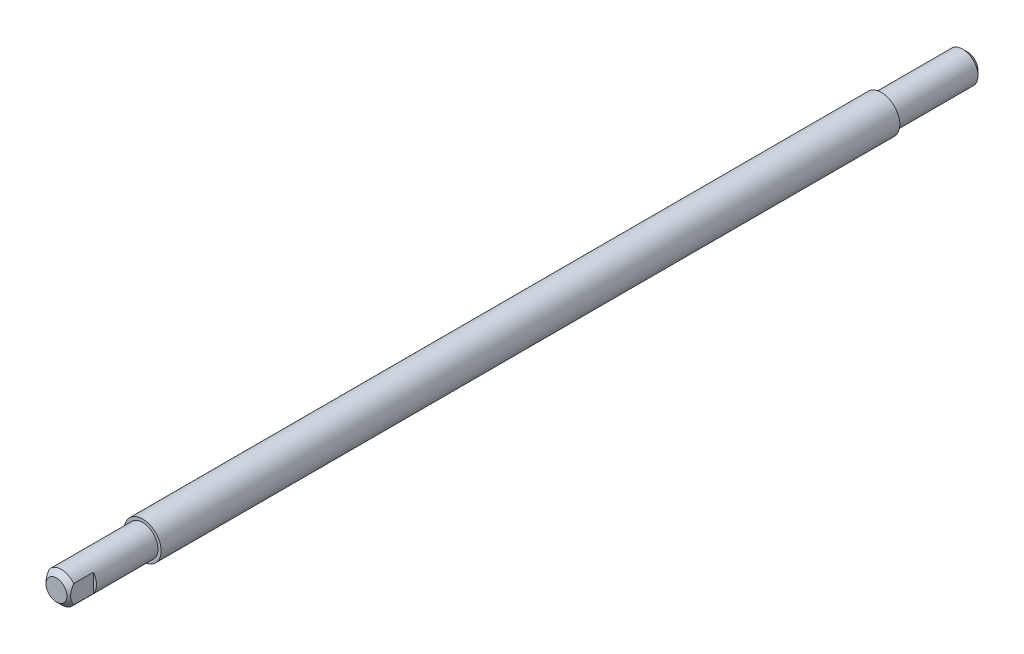
ISO-10303-21;
HEADER;
FILE_DESCRIPTION(('STEP AP214'),'2;1');
FILE_NAME('part.step','',(''),(''),'','','');
FILE_SCHEMA(('AUTOMOTIVE_DESIGN { 1 0 10303 214 1 1 1 1 }'));
ENDSEC;
DATA;
#1=APPLICATION_CONTEXT('core data for automotive mechanical design processes');
#2=APPLICATION_PROTOCOL_DEFINITION('international standard','automotive_design',2000,#1);
#3=PRODUCT_CONTEXT('',#1,'mechanical');
#4=PRODUCT('Part','Part','',(#3));
#5=PRODUCT_RELATED_PRODUCT_CATEGORY('part','',(#4));
#6=PRODUCT_DEFINITION_FORMATION('','',#4);
#7=PRODUCT_DEFINITION_CONTEXT('part definition',#1,'design');
#8=PRODUCT_DEFINITION('design','',#6,#7);
#9=PRODUCT_DEFINITION_SHAPE('','',#8);
#10=(LENGTH_UNIT() NAMED_UNIT(*) SI_UNIT(.MILLI.,.METRE.));
#11=(NAMED_UNIT(*) PLANE_ANGLE_UNIT() SI_UNIT($,.RADIAN.));
#12=(NAMED_UNIT(*) SI_UNIT($,.STERADIAN.) SOLID_ANGLE_UNIT());
#13=UNCERTAINTY_MEASURE_WITH_UNIT(LENGTH_MEASURE(1.E-05),#10,'distance_accuracy_value','');
#14=(GEOMETRIC_REPRESENTATION_CONTEXT(3) GLOBAL_UNCERTAINTY_ASSIGNED_CONTEXT((#13)) GLOBAL_UNIT_ASSIGNED_CONTEXT((#10,
#11,#12)) REPRESENTATION_CONTEXT('',''));
#15=CARTESIAN_POINT('',(0.,0.,0.));
#16=DIRECTION('',(0.,0.,1.));
#17=DIRECTION('',(1.,0.,0.));
#18=AXIS2_PLACEMENT_3D('',#15,#16,#17);
#19=CARTESIAN_POINT('',(0.,0.,234.95));
#20=DIRECTION('',(0.,0.,-1.));
#21=DIRECTION('',(-1.,0.,0.));
#22=AXIS2_PLACEMENT_3D('',#19,#20,#21);
#23=CYLINDRICAL_SURFACE('',#22,3.96875);
#24=CARTESIAN_POINT('',(0.,0.,1.26999999999999));
#25=DIRECTION('',(0.,0.,1.));
#26=DIRECTION('',(1.,0.,0.));
#27=AXIS2_PLACEMENT_3D('',#24,#25,#26);
#28=CIRCLE('',#27,3.96875);
#29=CARTESIAN_POINT('',(3.96875,0.,1.26999999999999));
#30=VERTEX_POINT('',#29);
#31=EDGE_CURVE('E118',#30,#30,#28,.T.);
#32=ORIENTED_EDGE('',*,*,#31,.T.);
#33=EDGE_LOOP('',(#32));
#34=FACE_BOUND('',#33,.T.);
#35=CARTESIAN_POINT('',(0.,0.,22.225));
#36=DIRECTION('',(0.,0.,-1.));
#37=DIRECTION('',(-1.,0.,0.));
#38=AXIS2_PLACEMENT_3D('',#35,#36,#37);
#39=CIRCLE('',#38,3.96875);
#40=CARTESIAN_POINT('',(-3.96875,0.,22.225));
#41=VERTEX_POINT('',#40);
#42=EDGE_CURVE('E129',#41,#41,#39,.T.);
#43=ORIENTED_EDGE('',*,*,#42,.T.);
#44=EDGE_LOOP('',(#43));
#45=FACE_BOUND('',#44,.T.);
#46=ADVANCED_FACE('F50',(#34,#45),#23,.T.);
#47=CARTESIAN_POINT('',(0.,0.,0.));
#48=DIRECTION('',(0.,0.,1.));
#49=DIRECTION('',(1.,0.,0.));
#50=AXIS2_PLACEMENT_3D('',#47,#48,#49);
#51=PLANE('',#50);
#52=CARTESIAN_POINT('',(0.,0.,0.));
#53=DIRECTION('',(0.,0.,1.));
#54=DIRECTION('',(1.,0.,0.));
#55=AXIS2_PLACEMENT_3D('',#52,#53,#54);
#56=CIRCLE('',#55,2.69875);
#57=CARTESIAN_POINT('',(2.69875,0.,0.));
#58=VERTEX_POINT('',#57);
#59=EDGE_CURVE('E122',#58,#58,#56,.F.);
#60=ORIENTED_EDGE('',*,*,#59,.T.);
#61=EDGE_LOOP('',(#60));
#62=FACE_BOUND('',#61,.T.);
#63=ADVANCED_FACE('F180',(#62),#51,.F.);
#64=CARTESIAN_POINT('',(0.,0.,1.26999999999999));
#65=DIRECTION('',(0.,0.,1.));
#66=DIRECTION('',(1.,0.,0.));
#67=AXIS2_PLACEMENT_3D('',#64,#65,#66);
#68=CONICAL_SURFACE('',#67,3.96875,0.78539816339745);
#69=ORIENTED_EDGE('',*,*,#59,.F.);
#70=EDGE_LOOP('',(#69));
#71=FACE_BOUND('',#70,.T.);
#72=ORIENTED_EDGE('',*,*,#31,.F.);
#73=EDGE_LOOP('',(#72));
#74=FACE_BOUND('',#73,.T.);
#75=ADVANCED_FACE('F52',(#71,#74),#68,.T.);
#76=CARTESIAN_POINT('',(-3.96874999999998,0.,212.725));
#77=DIRECTION('',(0.,0.,1.));
#78=DIRECTION('',(1.,0.,0.));
#79=AXIS2_PLACEMENT_3D('',#76,#77,#78);
#80=PLANE('',#79);
#81=CARTESIAN_POINT('',(0.,0.,212.725));
#82=DIRECTION('',(0.,0.,1.));
#83=DIRECTION('',(1.,0.,0.));
#84=AXIS2_PLACEMENT_3D('',#81,#82,#83);
#85=CIRCLE('',#84,3.96875);
#86=CARTESIAN_POINT('',(3.96875,0.,212.725));
#87=VERTEX_POINT('',#86);
#88=EDGE_CURVE('E125',#87,#87,#85,.T.);
#89=ORIENTED_EDGE('',*,*,#88,.F.);
#90=EDGE_LOOP('',(#89));
#91=FACE_BOUND('',#90,.T.);
#92=CARTESIAN_POINT('',(0.,0.,212.725));
#93=DIRECTION('',(0.,0.,-1.));
#94=DIRECTION('',(-1.,0.,0.));
#95=AXIS2_PLACEMENT_3D('',#92,#93,#94);
#96=CIRCLE('',#95,4.76249999999997);
#97=CARTESIAN_POINT('',(-4.76249999999997,0.,212.725));
#98=VERTEX_POINT('',#97);
#99=EDGE_CURVE('E97',#98,#98,#96,.T.);
#100=ORIENTED_EDGE('',*,*,#99,.F.);
#101=EDGE_LOOP('',(#100));
#102=FACE_BOUND('',#101,.T.);
#103=ADVANCED_FACE('F159',(#91,#102),#80,.T.);
#104=CARTESIAN_POINT('',(0.,0.,-16.320632546804));
#105=DIRECTION('',(0.,0.,-1.));
#106=DIRECTION('',(-1.,0.,0.));
#107=AXIS2_PLACEMENT_3D('',#104,#105,#106);
#108=CYLINDRICAL_SURFACE('',#107,4.76249999999998);
#109=ORIENTED_EDGE('',*,*,#99,.T.);
#110=EDGE_LOOP('',(#109));
#111=FACE_BOUND('',#110,.T.);
#112=CARTESIAN_POINT('',(0.,0.,22.225));
#113=DIRECTION('',(0.,0.,-1.));
#114=DIRECTION('',(-1.,0.,0.));
#115=AXIS2_PLACEMENT_3D('',#112,#113,#114);
#116=CIRCLE('',#115,4.7625);
#117=CARTESIAN_POINT('',(-4.7625,0.,22.225));
#118=VERTEX_POINT('',#117);
#119=EDGE_CURVE('E309',#118,#118,#116,.T.);
#120=ORIENTED_EDGE('',*,*,#119,.F.);
#121=EDGE_LOOP('',(#120));
#122=FACE_BOUND('',#121,.T.);
#123=ADVANCED_FACE('F162',(#111,#122),#108,.T.);
#124=CARTESIAN_POINT('',(-3.96875,0.,22.225));
#125=DIRECTION('',(0.,0.,-1.));
#126=DIRECTION('',(-1.,0.,0.));
#127=AXIS2_PLACEMENT_3D('',#124,#125,#126);
#128=PLANE('',#127);
#129=ORIENTED_EDGE('',*,*,#119,.T.);
#130=EDGE_LOOP('',(#129));
#131=FACE_BOUND('',#130,.T.);
#132=ORIENTED_EDGE('',*,*,#42,.F.);
#133=EDGE_LOOP('',(#132));
#134=FACE_BOUND('',#133,.T.);
#135=ADVANCED_FACE('F166',(#131,#134),#128,.T.);
#136=CARTESIAN_POINT('',(0.,0.,234.95));
#137=DIRECTION('',(0.,0.,1.));
#138=DIRECTION('',(1.,0.,0.));
#139=AXIS2_PLACEMENT_3D('',#136,#137,#138);
#140=PLANE('',#139);
#141=CARTESIAN_POINT('',(0.,0.,234.95));
#142=DIRECTION('',(0.,0.,1.));
#143=DIRECTION('',(1.,0.,0.));
#144=AXIS2_PLACEMENT_3D('',#141,#142,#143);
#145=CIRCLE('',#144,2.69875000000001);
#146=CARTESIAN_POINT('',(2.69875,0.,234.95));
#147=VERTEX_POINT('',#146);
#148=EDGE_CURVE('E115',#147,#147,#145,.T.);
#149=ORIENTED_EDGE('',*,*,#148,.T.);
#150=EDGE_LOOP('',(#149));
#151=FACE_BOUND('',#150,.T.);
#152=ADVANCED_FACE('F169',(#151),#140,.T.);
#153=CARTESIAN_POINT('',(3.96875000000002,-3.96875,228.6));
#154=DIRECTION('',(0.,0.,-1.));
#155=DIRECTION('',(-1.,0.,0.));
#156=AXIS2_PLACEMENT_3D('',#153,#154,#155);
#157=PLANE('',#156);
#158=DIRECTION('',(0.,1.,0.));
#159=VECTOR('',#158,1.);
#160=CARTESIAN_POINT('',(3.17500000000003,-3.96875,228.6));
#161=LINE('',#160,#159);
#162=CARTESIAN_POINT('',(3.17500000000002,-2.38124999999997,228.6));
#163=VERTEX_POINT('',#162);
#164=CARTESIAN_POINT('',(3.17500000000003,2.38124999999996,228.6));
#165=VERTEX_POINT('',#164);
#166=EDGE_CURVE('E105',#163,#165,#161,.T.);
#167=ORIENTED_EDGE('',*,*,#166,.F.);
#168=CARTESIAN_POINT('',(0.,0.,228.6));
#169=DIRECTION('',(0.,0.,-1.));
#170=DIRECTION('',(-1.,0.,0.));
#171=AXIS2_PLACEMENT_3D('',#168,#169,#170);
#172=CIRCLE('',#171,3.96875);
#173=EDGE_CURVE('E139',#165,#163,#172,.T.);
#174=ORIENTED_EDGE('',*,*,#173,.F.);
#175=EDGE_LOOP('',(#167,#174));
#176=FACE_BOUND('',#175,.T.);
#177=ADVANCED_FACE('F174',(#176),#157,.F.);
#178=CARTESIAN_POINT('',(3.17500000000003,-3.96875,228.6));
#179=DIRECTION('',(-1.,0.,0.));
#180=DIRECTION('',(0.,0.,1.));
#181=AXIS2_PLACEMENT_3D('',#178,#179,#180);
#182=PLANE('',#181);
#183=CARTESIAN_POINT('',(3.17500000000002,-5.78325018162707,231.051280207474));
#184=CARTESIAN_POINT('',(3.17500000000002,-5.64632479657924,231.171285469388));
#185=CARTESIAN_POINT('',(3.17500000000003,-5.50892779177499,231.290758495077));
#186=CARTESIAN_POINT('',(3.17500000000003,-5.23293779177755,231.528353140146));
#187=CARTESIAN_POINT('',(3.17500000000003,-5.09434463285967,231.646474569209));
#188=CARTESIAN_POINT('',(3.17500000000003,-4.81492910065498,231.881734632633));
#189=CARTESIAN_POINT('',(3.17500000000003,-4.67409841409708,231.998863414989));
#190=CARTESIAN_POINT('',(3.17500000000003,-4.39069596795591,232.230981133771));
#191=CARTESIAN_POINT('',(3.17500000000003,-4.24812432000275,232.345970206213));
#192=CARTESIAN_POINT('',(3.17500000000003,-3.94990485096295,232.581855948903));
#193=CARTESIAN_POINT('',(3.17500000000003,-3.79408647133764,232.702537774134));
#194=CARTESIAN_POINT('',(3.17500000000003,-3.47927861833636,232.939686998169));
#195=CARTESIAN_POINT('',(3.17500000000003,-3.32028942686246,233.056154769056));
#196=CARTESIAN_POINT('',(3.17500000000003,-2.99860258159018,233.283058776025));
#197=CARTESIAN_POINT('',(3.17500000000003,-2.83591458283203,233.393508619438));
#198=CARTESIAN_POINT('',(3.17500000000003,-2.50535426762209,233.606301766068));
#199=CARTESIAN_POINT('',(3.17500000000003,-2.33748461623088,233.708649143127));
#200=CARTESIAN_POINT('',(3.17500000000003,-2.05073499996866,233.87024887126));
#201=CARTESIAN_POINT('',(3.17500000000003,-1.93366543636979,233.932696345507));
#202=CARTESIAN_POINT('',(3.17500000000003,-1.69599314979767,234.050644686561));
#203=CARTESIAN_POINT('',(3.17500000000003,-1.57538944323401,234.106143596407));
#204=CARTESIAN_POINT('',(3.17500000000003,-1.33182173625757,234.207491074043));
#205=CARTESIAN_POINT('',(3.17500000000003,-1.20890274728884,234.253446375068));
#206=CARTESIAN_POINT('',(3.17500000000003,-0.959399491079349,234.334058502219));
#207=CARTESIAN_POINT('',(3.17500000000003,-0.832817419856244,234.368721951047));
#208=CARTESIAN_POINT('',(3.17500000000003,-0.611751283219239,234.416627134184));
#209=CARTESIAN_POINT('',(3.17500000000003,-0.517975658667672,234.433136026415));
#210=CARTESIAN_POINT('',(3.17500000000003,-0.329355685775057,234.458080308119));
#211=CARTESIAN_POINT('',(3.17500000000003,-0.234511569756814,234.466517419629));
#212=CARTESIAN_POINT('',(3.17500000000003,-0.0446050530399451,234.47485120548));
#213=CARTESIAN_POINT('',(3.17500000000003,0.0504567004755422,234.474762405637));
#214=CARTESIAN_POINT('',(3.17500000000003,0.240198292778957,234.466089080997));
#215=CARTESIAN_POINT('',(3.17500000000003,0.334878061513709,234.457503063173));
#216=CARTESIAN_POINT('',(3.17500000000003,0.543538088796841,234.429559318412));
#217=CARTESIAN_POINT('',(3.17500000000003,0.65726003352206,234.408272282409));
#218=CARTESIAN_POINT('',(3.17500000000003,0.882230026530255,234.355275649816));
#219=CARTESIAN_POINT('',(3.17500000000003,0.993477200233816,234.323562429196));
#220=CARTESIAN_POINT('',(3.17500000000003,1.21482367872007,234.250910736841));
#221=CARTESIAN_POINT('',(3.17500000000003,1.32487741597348,234.209835024753));
#222=CARTESIAN_POINT('',(3.17500000000003,1.48768178520232,234.142843922773));
#223=CARTESIAN_POINT('',(3.17500000000003,1.54156607942109,234.119619488901));
#224=CARTESIAN_POINT('',(3.17500000000003,1.64861121874325,234.071564222546));
#225=CARTESIAN_POINT('',(3.17500000000003,1.70177210097693,234.046733472889));
#226=CARTESIAN_POINT('',(3.17500000000003,1.86878948462338,233.965953030637));
#227=CARTESIAN_POINT('',(3.17500000000003,1.98137927401281,233.907376983165));
#228=CARTESIAN_POINT('',(3.17500000000003,2.20371363271771,233.785025868323));
#229=CARTESIAN_POINT('',(3.17500000000003,2.31345717428476,233.721248956502));
#230=CARTESIAN_POINT('',(3.17500000000003,2.53059715044188,233.589551957182));
#231=CARTESIAN_POINT('',(3.17500000000003,2.63799062408732,233.521627010527));
#232=CARTESIAN_POINT('',(3.17500000000003,2.8506725861586,233.382546840962));
#233=CARTESIAN_POINT('',(3.17500000000003,2.95596082185337,233.311391233528));
#234=CARTESIAN_POINT('',(3.17500000000003,3.16539186832447,233.166048759312));
#235=CARTESIAN_POINT('',(3.17500000000002,3.2695234502373,233.09184576402));
#236=CARTESIAN_POINT('',(3.17500000000002,3.47624549345331,232.941319470728));
#237=CARTESIAN_POINT('',(3.17500000000002,3.57883587819868,232.864996067933));
#238=CARTESIAN_POINT('',(3.17500000000002,3.8844996023188,232.63355669121));
#239=CARTESIAN_POINT('',(3.17500000000002,4.08562026993167,232.475862390488));
#240=CARTESIAN_POINT('',(3.17500000000002,4.46060627321295,232.174559478772));
#241=CARTESIAN_POINT('',(3.17500000000002,4.63489609055385,232.031474455738));
#242=CARTESIAN_POINT('',(3.17500000000002,4.98118866424246,231.742502384854));
#243=CARTESIAN_POINT('',(3.17500000000002,5.15319099755769,231.596614830589));
#244=CARTESIAN_POINT('',(3.17500000000002,5.49310484713005,231.304671460912));
#245=CARTESIAN_POINT('',(3.17500000000002,5.66104036715597,231.158643508011));
#246=CARTESIAN_POINT('',(3.17500000000002,5.99542375738034,230.864985323863));
#247=CARTESIAN_POINT('',(3.17500000000002,6.16187202505755,230.717355545582));
#248=CARTESIAN_POINT('',(3.17500000000003,6.32776650522697,230.569113431314));
#249=B_SPLINE_CURVE_WITH_KNOTS('',3,(#183,#184,#185,#186,#187,#188,#189,#190,#191,#192,#193,
#194,#195,#196,#197,#198,#199,#200,#201,#202,#203,#204,#205,#206,#207,#208,#209,#210,#211,#212,
#213,#214,#215,#216,#217,#218,#219,#220,#221,#222,#223,#224,#225,#226,#227,#228,#229,#230,#231,
#232,#233,#234,#235,#236,#237,#238,#239,#240,#241,#242,#243,#244,#245,#246,#247,#248),
.UNSPECIFIED.,.F.,.F.,(4,2,2,2,2,2,2,2,2,2,2,2,2,2,2,2,2,2,2,2,2,2,2,2,2,2,2,2,2,2,2,2,4),(0.,
0.546217179558988,1.09251034778344,1.64201323045215,2.19148106221013,2.7826916127948,
3.37384983387739,3.96361059339487,4.55307291832712,4.95095197367467,5.34894283493716,
5.74220938713478,6.13524487041552,6.42058843222445,6.7058711051536,6.99066774325955,
7.27551443121213,7.62201750654849,7.96864115019815,8.32071609037011,8.49672382434774,
8.67272249010623,9.05327320726021,9.43395947603701,9.81510058251806,10.1962871730615,
10.5798495370327,10.9634308915911,11.7300257889622,12.4064961010063,13.083089822525,
13.7507152119494,14.4181564898844),.UNSPECIFIED.);
#250=CARTESIAN_POINT('',(3.17500000000003,2.38124999999996,233.68));
#251=VERTEX_POINT('',#250);
#252=CARTESIAN_POINT('',(3.17500000000003,-2.38125,233.68));
#253=VERTEX_POINT('',#252);
#254=EDGE_CURVE('E133',#251,#253,#249,.F.);
#255=ORIENTED_EDGE('',*,*,#254,.T.);
#256=DIRECTION('',(0.,0.,-1.));
#257=VECTOR('',#256,1.);
#258=CARTESIAN_POINT('',(3.17500000000002,-2.38124999999997,234.95));
#259=LINE('',#258,#257);
#260=EDGE_CURVE('E108',#163,#253,#259,.F.);
#261=ORIENTED_EDGE('',*,*,#260,.F.);
#262=ORIENTED_EDGE('',*,*,#166,.T.);
#263=DIRECTION('',(0.,0.,-1.));
#264=VECTOR('',#263,1.);
#265=CARTESIAN_POINT('',(3.17500000000003,2.38124999999996,234.95));
#266=LINE('',#265,#264);
#267=EDGE_CURVE('E113',#251,#165,#266,.T.);
#268=ORIENTED_EDGE('',*,*,#267,.F.);
#269=EDGE_LOOP('',(#255,#261,#262,#268));
#270=FACE_BOUND('',#269,.T.);
#271=ADVANCED_FACE('F140',(#270),#182,.F.);
#272=CARTESIAN_POINT('',(0.,0.,234.95));
#273=DIRECTION('',(0.,0.,-1.));
#274=DIRECTION('',(-1.,0.,0.));
#275=AXIS2_PLACEMENT_3D('',#272,#273,#274);
#276=CONICAL_SURFACE('',#275,2.69875000000001,0.785398163397448);
#277=CARTESIAN_POINT('',(-3.17499999999997,-5.78325018162706,231.051280207474));
#278=CARTESIAN_POINT('',(-3.17499999999997,-5.64632479657924,231.171285469388));
#279=CARTESIAN_POINT('',(-3.17499999999998,-5.50892779177501,231.290758495077));
#280=CARTESIAN_POINT('',(-3.17499999999998,-5.23293779177758,231.528353140146));
#281=CARTESIAN_POINT('',(-3.17499999999998,-5.09434463285969,231.646474569209));
#282=CARTESIAN_POINT('',(-3.17499999999998,-4.81492910065501,231.881734632633));
#283=CARTESIAN_POINT('',(-3.17499999999998,-4.67409841409712,231.998863414989));
#284=CARTESIAN_POINT('',(-3.17499999999998,-4.39069596795596,232.230981133771));
#285=CARTESIAN_POINT('',(-3.17499999999998,-4.24812432000279,232.345970206213));
#286=CARTESIAN_POINT('',(-3.17499999999998,-3.94990485096299,232.581855948903));
#287=CARTESIAN_POINT('',(-3.17499999999998,-3.79408647133768,232.702537774134));
#288=CARTESIAN_POINT('',(-3.17499999999998,-3.4792786183364,232.939686998169));
#289=CARTESIAN_POINT('',(-3.17499999999998,-3.32028942686249,233.056154769056));
#290=CARTESIAN_POINT('',(-3.17499999999998,-2.9986025815902,233.283058776025));
#291=CARTESIAN_POINT('',(-3.17499999999998,-2.83591458283205,233.393508619438));
#292=CARTESIAN_POINT('',(-3.17499999999997,-2.5053542676221,233.606301766068));
#293=CARTESIAN_POINT('',(-3.17499999999997,-2.3374846162309,233.708649143127));
#294=CARTESIAN_POINT('',(-3.17499999999997,-2.05073499996869,233.87024887126));
#295=CARTESIAN_POINT('',(-3.17499999999998,-1.93366543636982,233.932696345507));
#296=CARTESIAN_POINT('',(-3.17499999999998,-1.6959931497977,234.050644686561));
#297=CARTESIAN_POINT('',(-3.17499999999998,-1.57538944323404,234.106143596407));
#298=CARTESIAN_POINT('',(-3.17499999999998,-1.33182173625761,234.207491074043));
#299=CARTESIAN_POINT('',(-3.17499999999998,-1.20890274728888,234.253446375068));
#300=CARTESIAN_POINT('',(-3.17499999999997,-0.959399491079381,234.334058502219));
#301=CARTESIAN_POINT('',(-3.17499999999997,-0.832817419856274,234.368721951047));
#302=CARTESIAN_POINT('',(-3.17499999999997,-0.611751283219268,234.416627134184));
#303=CARTESIAN_POINT('',(-3.17499999999997,-0.517975658667703,234.433136026415));
#304=CARTESIAN_POINT('',(-3.17499999999998,-0.329355685775092,234.458080308119));
#305=CARTESIAN_POINT('',(-3.17499999999998,-0.234511569756851,234.466517419629));
#306=CARTESIAN_POINT('',(-3.17499999999998,-0.0446050530399848,234.47485120548));
#307=CARTESIAN_POINT('',(-3.17499999999998,0.0504567004755009,234.474762405637));
#308=CARTESIAN_POINT('',(-3.17499999999998,0.240198292778911,234.466089080997));
#309=CARTESIAN_POINT('',(-3.17499999999998,0.334878061513661,234.457503063173));
#310=CARTESIAN_POINT('',(-3.17499999999998,0.54353808879679,234.429559318412));
#311=CARTESIAN_POINT('',(-3.17499999999998,0.657260033522008,234.408272282409));
#312=CARTESIAN_POINT('',(-3.17499999999998,0.882230026530198,234.355275649816));
#313=CARTESIAN_POINT('',(-3.17499999999998,0.993477200233755,234.323562429196));
#314=CARTESIAN_POINT('',(-3.17499999999998,1.21482367872,234.250910736841));
#315=CARTESIAN_POINT('',(-3.17499999999998,1.3248774159734,234.209835024753));
#316=CARTESIAN_POINT('',(-3.17499999999998,1.48768178520224,234.142843922773));
#317=CARTESIAN_POINT('',(-3.17499999999998,1.54156607942101,234.119619488901));
#318=CARTESIAN_POINT('',(-3.17499999999998,1.64861121874316,234.071564222546));
#319=CARTESIAN_POINT('',(-3.17499999999998,1.70177210097684,234.046733472889));
#320=CARTESIAN_POINT('',(-3.17499999999998,1.86878948462326,233.965953030637));
#321=CARTESIAN_POINT('',(-3.17499999999998,1.98137927401269,233.907376983165));
#322=CARTESIAN_POINT('',(-3.17499999999998,2.20371363271759,233.785025868323));
#323=CARTESIAN_POINT('',(-3.17499999999998,2.31345717428462,233.721248956502));
#324=CARTESIAN_POINT('',(-3.17499999999998,2.53059715044172,233.589551957182));
#325=CARTESIAN_POINT('',(-3.17499999999998,2.63799062408715,233.521627010527));
#326=CARTESIAN_POINT('',(-3.17499999999998,2.85067258615842,233.382546840962));
#327=CARTESIAN_POINT('',(-3.17499999999998,2.95596082185317,233.311391233529));
#328=CARTESIAN_POINT('',(-3.17499999999998,3.16539186832425,233.166048759312));
#329=CARTESIAN_POINT('',(-3.17499999999998,3.26952345023706,233.09184576402));
#330=CARTESIAN_POINT('',(-3.17499999999998,3.47624549345305,232.941319470729));
#331=CARTESIAN_POINT('',(-3.17499999999998,3.57883587819842,232.864996067933));
#332=CARTESIAN_POINT('',(-3.17499999999998,3.8844996023185,232.63355669121));
#333=CARTESIAN_POINT('',(-3.17499999999998,4.08562026993135,232.475862390488));
#334=CARTESIAN_POINT('',(-3.17499999999998,4.4606062732126,232.174559478772));
#335=CARTESIAN_POINT('',(-3.17499999999998,4.63489609055348,232.031474455738));
#336=CARTESIAN_POINT('',(-3.17499999999998,4.98118866424207,231.742502384855));
#337=CARTESIAN_POINT('',(-3.17499999999998,5.15319099755729,231.596614830589));
#338=CARTESIAN_POINT('',(-3.17499999999998,5.49310484712962,231.304671460912));
#339=CARTESIAN_POINT('',(-3.17499999999998,5.66104036715554,231.158643508012));
#340=CARTESIAN_POINT('',(-3.17499999999998,5.99542375737988,230.864985323863));
#341=CARTESIAN_POINT('',(-3.17499999999998,6.16187202505706,230.717355545582));
#342=CARTESIAN_POINT('',(-3.17499999999998,6.32776650522647,230.569113431315));
#343=B_SPLINE_CURVE_WITH_KNOTS('',3,(#277,#278,#279,#280,#281,#282,#283,#284,#285,#286,#287,
#288,#289,#290,#291,#292,#293,#294,#295,#296,#297,#298,#299,#300,#301,#302,#303,#304,#305,#306,
#307,#308,#309,#310,#311,#312,#313,#314,#315,#316,#317,#318,#319,#320,#321,#322,#323,#324,#325,
#326,#327,#328,#329,#330,#331,#332,#333,#334,#335,#336,#337,#338,#339,#340,#341,#342),
.UNSPECIFIED.,.F.,.F.,(4,2,2,2,2,2,2,2,2,2,2,2,2,2,2,2,2,2,2,2,2,2,2,2,2,2,2,2,2,2,2,2,4),(0.,
0.546217179558961,1.09251034778338,1.64201323045209,2.19148106221007,2.78269161279476,
3.37384983387736,3.96361059339485,4.55307291832709,4.95095197367463,5.34894283493712,
5.74220938713476,6.13524487041551,6.42058843222442,6.70587110515357,6.99066774325951,
7.27551443121209,7.62201750654844,7.96864115019809,8.32071609037003,8.49672382434765,
8.67272249010613,9.05327320726007,9.43395947603685,9.81510058251787,10.1962871730613,
10.5798495370324,10.9634308915907,11.7300257889618,12.4064961010058,13.0830898225245,
13.7507152119488,14.4181564898837),.UNSPECIFIED.);
#344=CARTESIAN_POINT('',(-3.17499999999997,-2.38125000000004,233.68));
#345=VERTEX_POINT('',#344);
#346=CARTESIAN_POINT('',(-3.17499999999998,2.38125000000004,233.68));
#347=VERTEX_POINT('',#346);
#348=EDGE_CURVE('E58',#345,#347,#343,.T.);
#349=ORIENTED_EDGE('',*,*,#348,.F.);
#350=CARTESIAN_POINT('',(0.,0.,233.68));
#351=DIRECTION('',(0.,0.,1.));
#352=DIRECTION('',(1.,0.,0.));
#353=AXIS2_PLACEMENT_3D('',#350,#351,#352);
#354=CIRCLE('',#353,3.96875);
#355=EDGE_CURVE('E104',#253,#345,#354,.F.);
#356=ORIENTED_EDGE('',*,*,#355,.F.);
#357=ORIENTED_EDGE('',*,*,#254,.F.);
#358=EDGE_CURVE('E73',#347,#251,#354,.F.);
#359=ORIENTED_EDGE('',*,*,#358,.F.);
#360=EDGE_LOOP('',(#349,#356,#357,#359));
#361=FACE_BOUND('',#360,.T.);
#362=ORIENTED_EDGE('',*,*,#148,.F.);
#363=EDGE_LOOP('',(#362));
#364=FACE_BOUND('',#363,.T.);
#365=ADVANCED_FACE('F144',(#361,#364),#276,.T.);
#366=CARTESIAN_POINT('',(-3.96875,-3.96875,228.6));
#367=DIRECTION('',(0.,0.,-1.));
#368=DIRECTION('',(-1.,0.,0.));
#369=AXIS2_PLACEMENT_3D('',#366,#367,#368);
#370=PLANE('',#369);
#371=CARTESIAN_POINT('',(0.,0.,228.6));
#372=DIRECTION('',(0.,0.,-1.));
#373=DIRECTION('',(-1.,0.,0.));
#374=AXIS2_PLACEMENT_3D('',#371,#372,#373);
#375=CIRCLE('',#374,3.96875);
#376=CARTESIAN_POINT('',(-3.17499999999998,-2.38125000000004,228.6));
#377=VERTEX_POINT('',#376);
#378=CARTESIAN_POINT('',(-3.17499999999998,2.38125000000003,228.6));
#379=VERTEX_POINT('',#378);
#380=EDGE_CURVE('E13',#377,#379,#375,.T.);
#381=ORIENTED_EDGE('',*,*,#380,.F.);
#382=DIRECTION('',(0.,1.,0.));
#383=VECTOR('',#382,1.);
#384=CARTESIAN_POINT('',(-3.17499999999998,-3.96875,228.6));
#385=LINE('',#384,#383);
#386=EDGE_CURVE('E94',#377,#379,#385,.T.);
#387=ORIENTED_EDGE('',*,*,#386,.T.);
#388=EDGE_LOOP('',(#381,#387));
#389=FACE_BOUND('',#388,.T.);
#390=ADVANCED_FACE('F93',(#389),#370,.F.);
#391=CARTESIAN_POINT('',(-3.17499999999998,-3.96875,228.6));
#392=DIRECTION('',(1.,0.,0.));
#393=DIRECTION('',(0.,0.,-1.));
#394=AXIS2_PLACEMENT_3D('',#391,#392,#393);
#395=PLANE('',#394);
#396=ORIENTED_EDGE('',*,*,#348,.T.);
#397=DIRECTION('',(0.,0.,-1.));
#398=VECTOR('',#397,1.);
#399=CARTESIAN_POINT('',(-3.17499999999998,2.38125000000003,234.95));
#400=LINE('',#399,#398);
#401=EDGE_CURVE('E96',#379,#347,#400,.F.);
#402=ORIENTED_EDGE('',*,*,#401,.F.);
#403=ORIENTED_EDGE('',*,*,#386,.F.);
#404=DIRECTION('',(0.,0.,-1.));
#405=VECTOR('',#404,1.);
#406=CARTESIAN_POINT('',(-3.17499999999998,-2.38125000000004,234.95));
#407=LINE('',#406,#405);
#408=EDGE_CURVE('E65',#345,#377,#407,.T.);
#409=ORIENTED_EDGE('',*,*,#408,.F.);
#410=EDGE_LOOP('',(#396,#402,#403,#409));
#411=FACE_BOUND('',#410,.T.);
#412=ADVANCED_FACE('F95',(#411),#395,.F.);
#413=ORIENTED_EDGE('',*,*,#408,.T.);
#414=ORIENTED_EDGE('',*,*,#380,.T.);
#415=ORIENTED_EDGE('',*,*,#401,.T.);
#416=ORIENTED_EDGE('',*,*,#358,.T.);
#417=ORIENTED_EDGE('',*,*,#267,.T.);
#418=ORIENTED_EDGE('',*,*,#173,.T.);
#419=ORIENTED_EDGE('',*,*,#260,.T.);
#420=ORIENTED_EDGE('',*,*,#355,.T.);
#421=EDGE_LOOP('',(#413,#414,#415,#416,#417,#418,#419,#420));
#422=FACE_BOUND('',#421,.T.);
#423=ORIENTED_EDGE('',*,*,#88,.T.);
#424=EDGE_LOOP('',(#423));
#425=FACE_BOUND('',#424,.T.);
#426=ADVANCED_FACE('F100',(#422,#425),#23,.T.);
#427=CLOSED_SHELL('',(#46,#63,#75,#103,#123,#135,#152,#177,#271,#365,#390,#412,#426));
#428=MANIFOLD_SOLID_BREP('B2',#427);
#429=ADVANCED_BREP_SHAPE_REPRESENTATION('',(#18,#428),#14);
#430=SHAPE_DEFINITION_REPRESENTATION(#9,#429);
ENDSEC;
END-ISO-10303-21;
